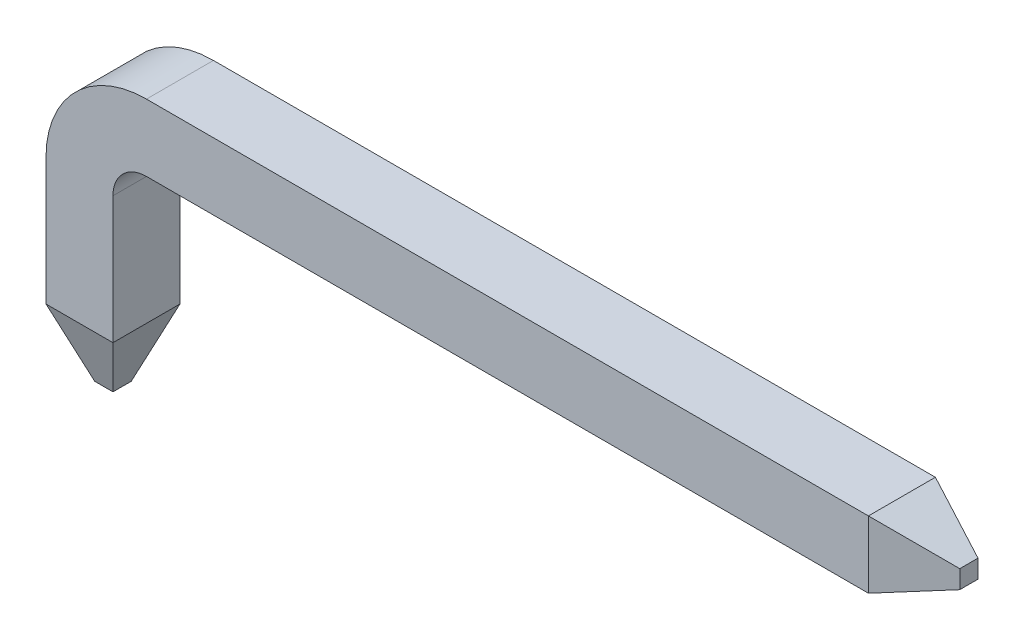
ISO-10303-21;
HEADER;
FILE_DESCRIPTION(('STEP AP214'),'2;1');
FILE_NAME('part.step','',(''),(''),'','','');
FILE_SCHEMA(('AUTOMOTIVE_DESIGN { 1 0 10303 214 1 1 1 1 }'));
ENDSEC;
DATA;
#1=APPLICATION_CONTEXT('core data for automotive mechanical design processes');
#2=APPLICATION_PROTOCOL_DEFINITION('international standard','automotive_design',2000,#1);
#3=PRODUCT_CONTEXT('',#1,'mechanical');
#4=PRODUCT('Part','Part','',(#3));
#5=PRODUCT_RELATED_PRODUCT_CATEGORY('part','',(#4));
#6=PRODUCT_DEFINITION_FORMATION('','',#4);
#7=PRODUCT_DEFINITION_CONTEXT('part definition',#1,'design');
#8=PRODUCT_DEFINITION('design','',#6,#7);
#9=PRODUCT_DEFINITION_SHAPE('','',#8);
#10=(LENGTH_UNIT() NAMED_UNIT(*) SI_UNIT(.MILLI.,.METRE.));
#11=(NAMED_UNIT(*) PLANE_ANGLE_UNIT() SI_UNIT($,.RADIAN.));
#12=(NAMED_UNIT(*) SI_UNIT($,.STERADIAN.) SOLID_ANGLE_UNIT());
#13=UNCERTAINTY_MEASURE_WITH_UNIT(LENGTH_MEASURE(1.E-05),#10,'distance_accuracy_value','');
#14=(GEOMETRIC_REPRESENTATION_CONTEXT(3) GLOBAL_UNCERTAINTY_ASSIGNED_CONTEXT((#13)) GLOBAL_UNIT_ASSIGNED_CONTEXT((#10,
#11,#12)) REPRESENTATION_CONTEXT('',''));
#15=CARTESIAN_POINT('',(0.,0.,0.));
#16=DIRECTION('',(0.,0.,1.));
#17=DIRECTION('',(1.,0.,0.));
#18=AXIS2_PLACEMENT_3D('',#15,#16,#17);
#19=CARTESIAN_POINT('',(0.75,1.2,0.));
#20=DIRECTION('',(0.,-1.,0.));
#21=DIRECTION('',(1.,0.,0.));
#22=AXIS2_PLACEMENT_3D('',#19,#20,#21);
#23=PLANE('',#22);
#24=DIRECTION('',(0.,0.,-1.));
#25=VECTOR('',#24,1.);
#26=CARTESIAN_POINT('',(0.75,1.2,0.));
#27=LINE('',#26,#25);
#28=CARTESIAN_POINT('',(0.75,1.2,0.));
#29=VERTEX_POINT('',#28);
#30=CARTESIAN_POINT('',(0.75,1.2,-0.5));
#31=VERTEX_POINT('',#30);
#32=EDGE_CURVE('E175',#29,#31,#27,.T.);
#33=ORIENTED_EDGE('',*,*,#32,.T.);
#34=DIRECTION('',(1.,0.,0.));
#35=VECTOR('',#34,1.);
#36=CARTESIAN_POINT('',(0.75,1.2,-0.5));
#37=LINE('',#36,#35);
#38=CARTESIAN_POINT('',(6.14,1.2,-0.5));
#39=VERTEX_POINT('',#38);
#40=EDGE_CURVE('E199',#31,#39,#37,.T.);
#41=ORIENTED_EDGE('',*,*,#40,.T.);
#42=DIRECTION('',(0.,0.,-1.));
#43=VECTOR('',#42,1.);
#44=CARTESIAN_POINT('',(6.14,1.2,0.));
#45=LINE('',#44,#43);
#46=CARTESIAN_POINT('',(6.14,1.2,0.));
#47=VERTEX_POINT('',#46);
#48=EDGE_CURVE('E53',#47,#39,#45,.T.);
#49=ORIENTED_EDGE('',*,*,#48,.F.);
#50=DIRECTION('',(1.,0.,0.));
#51=VECTOR('',#50,1.);
#52=CARTESIAN_POINT('',(0.75,1.2,0.));
#53=LINE('',#52,#51);
#54=EDGE_CURVE('E39',#29,#47,#53,.T.);
#55=ORIENTED_EDGE('',*,*,#54,.F.);
#56=EDGE_LOOP('',(#33,#41,#49,#55));
#57=FACE_BOUND('',#56,.T.);
#58=ADVANCED_FACE('F32',(#57),#23,.T.);
#59=CARTESIAN_POINT('',(0.75,1.7,0.));
#60=DIRECTION('',(0.,1.,0.));
#61=DIRECTION('',(-1.,0.,0.));
#62=AXIS2_PLACEMENT_3D('',#59,#60,#61);
#63=PLANE('',#62);
#64=DIRECTION('',(0.,0.,1.));
#65=VECTOR('',#64,1.);
#66=CARTESIAN_POINT('',(0.75,1.7,0.));
#67=LINE('',#66,#65);
#68=CARTESIAN_POINT('',(0.75,1.7,-0.5));
#69=VERTEX_POINT('',#68);
#70=CARTESIAN_POINT('',(0.75,1.7,0.));
#71=VERTEX_POINT('',#70);
#72=EDGE_CURVE('E172',#69,#71,#67,.T.);
#73=ORIENTED_EDGE('',*,*,#72,.T.);
#74=DIRECTION('',(1.,0.,0.));
#75=VECTOR('',#74,1.);
#76=CARTESIAN_POINT('',(0.75,1.7,0.));
#77=LINE('',#76,#75);
#78=CARTESIAN_POINT('',(6.14,1.7,0.));
#79=VERTEX_POINT('',#78);
#80=EDGE_CURVE('E11',#71,#79,#77,.T.);
#81=ORIENTED_EDGE('',*,*,#80,.T.);
#82=DIRECTION('',(0.,0.,1.));
#83=VECTOR('',#82,1.);
#84=CARTESIAN_POINT('',(6.14,1.7,0.));
#85=LINE('',#84,#83);
#86=CARTESIAN_POINT('',(6.14,1.7,-0.5));
#87=VERTEX_POINT('',#86);
#88=EDGE_CURVE('E189',#87,#79,#85,.T.);
#89=ORIENTED_EDGE('',*,*,#88,.F.);
#90=DIRECTION('',(1.,0.,0.));
#91=VECTOR('',#90,1.);
#92=CARTESIAN_POINT('',(0.75,1.7,-0.5));
#93=LINE('',#92,#91);
#94=EDGE_CURVE('E197',#69,#87,#93,.T.);
#95=ORIENTED_EDGE('',*,*,#94,.F.);
#96=EDGE_LOOP('',(#73,#81,#89,#95));
#97=FACE_BOUND('',#96,.T.);
#98=ADVANCED_FACE('F268',(#97),#63,.T.);
#99=CARTESIAN_POINT('',(0.75,0.95,0.));
#100=DIRECTION('',(0.,0.,-1.));
#101=DIRECTION('',(-1.,0.,0.));
#102=AXIS2_PLACEMENT_3D('',#99,#100,#101);
#103=CYLINDRICAL_SURFACE('',#102,0.25);
#104=DIRECTION('',(0.,0.,-1.));
#105=VECTOR('',#104,1.);
#106=CARTESIAN_POINT('',(0.5,0.95,0.));
#107=LINE('',#106,#105);
#108=CARTESIAN_POINT('',(0.5,0.95,0.));
#109=VERTEX_POINT('',#108);
#110=CARTESIAN_POINT('',(0.5,0.95,-0.5));
#111=VERTEX_POINT('',#110);
#112=EDGE_CURVE('E160',#109,#111,#107,.T.);
#113=ORIENTED_EDGE('',*,*,#112,.T.);
#114=CARTESIAN_POINT('',(0.75,0.95,-0.5));
#115=DIRECTION('',(0.,0.,-1.));
#116=DIRECTION('',(-1.,0.,0.));
#117=AXIS2_PLACEMENT_3D('',#114,#115,#116);
#118=CIRCLE('',#117,0.25);
#119=EDGE_CURVE('E180',#111,#31,#118,.T.);
#120=ORIENTED_EDGE('',*,*,#119,.T.);
#121=ORIENTED_EDGE('',*,*,#32,.F.);
#122=CARTESIAN_POINT('',(0.75,0.95,0.));
#123=DIRECTION('',(0.,0.,-1.));
#124=DIRECTION('',(-1.,0.,0.));
#125=AXIS2_PLACEMENT_3D('',#122,#123,#124);
#126=CIRCLE('',#125,0.25);
#127=EDGE_CURVE('E183',#109,#29,#126,.T.);
#128=ORIENTED_EDGE('',*,*,#127,.F.);
#129=EDGE_LOOP('',(#113,#120,#121,#128));
#130=FACE_BOUND('',#129,.T.);
#131=ADVANCED_FACE('F272',(#130),#103,.F.);
#132=CARTESIAN_POINT('',(0.75,0.95,0.));
#133=DIRECTION('',(0.,0.,-1.));
#134=DIRECTION('',(-1.,0.,0.));
#135=AXIS2_PLACEMENT_3D('',#132,#133,#134);
#136=CYLINDRICAL_SURFACE('',#135,0.75);
#137=DIRECTION('',(0.,0.,1.));
#138=VECTOR('',#137,1.);
#139=CARTESIAN_POINT('',(0.,0.95,0.));
#140=LINE('',#139,#138);
#141=CARTESIAN_POINT('',(0.,0.95,-0.5));
#142=VERTEX_POINT('',#141);
#143=CARTESIAN_POINT('',(0.,0.95,0.));
#144=VERTEX_POINT('',#143);
#145=EDGE_CURVE('E155',#142,#144,#140,.T.);
#146=ORIENTED_EDGE('',*,*,#145,.T.);
#147=CARTESIAN_POINT('',(0.75,0.95,0.));
#148=DIRECTION('',(0.,0.,-1.));
#149=DIRECTION('',(-1.,0.,0.));
#150=AXIS2_PLACEMENT_3D('',#147,#148,#149);
#151=CIRCLE('',#150,0.75);
#152=EDGE_CURVE('E186',#144,#71,#151,.T.);
#153=ORIENTED_EDGE('',*,*,#152,.T.);
#154=ORIENTED_EDGE('',*,*,#72,.F.);
#155=CARTESIAN_POINT('',(0.75,0.95,-0.5));
#156=DIRECTION('',(0.,0.,-1.));
#157=DIRECTION('',(-1.,0.,0.));
#158=AXIS2_PLACEMENT_3D('',#155,#156,#157);
#159=CIRCLE('',#158,0.75);
#160=EDGE_CURVE('E178',#142,#69,#159,.T.);
#161=ORIENTED_EDGE('',*,*,#160,.F.);
#162=EDGE_LOOP('',(#146,#153,#154,#161));
#163=FACE_BOUND('',#162,.T.);
#164=ADVANCED_FACE('F307',(#163),#136,.T.);
#165=CARTESIAN_POINT('',(0.,0.95,0.));
#166=DIRECTION('',(1.,0.,0.));
#167=DIRECTION('',(0.,0.,-1.));
#168=AXIS2_PLACEMENT_3D('',#165,#166,#167);
#169=PLANE('',#168);
#170=DIRECTION('',(0.,0.,1.));
#171=VECTOR('',#170,1.);
#172=CARTESIAN_POINT('',(0.,0.,0.));
#173=LINE('',#172,#171);
#174=CARTESIAN_POINT('',(0.,0.,-0.5));
#175=VERTEX_POINT('',#174);
#176=CARTESIAN_POINT('',(0.,0.,0.));
#177=VERTEX_POINT('',#176);
#178=EDGE_CURVE('E135',#175,#177,#173,.T.);
#179=ORIENTED_EDGE('',*,*,#178,.T.);
#180=DIRECTION('',(0.,-1.,0.));
#181=VECTOR('',#180,1.);
#182=CARTESIAN_POINT('',(0.,0.95,0.));
#183=LINE('',#182,#181);
#184=EDGE_CURVE('E170',#144,#177,#183,.T.);
#185=ORIENTED_EDGE('',*,*,#184,.F.);
#186=ORIENTED_EDGE('',*,*,#145,.F.);
#187=DIRECTION('',(0.,-1.,0.));
#188=VECTOR('',#187,1.);
#189=CARTESIAN_POINT('',(0.,0.95,-0.5));
#190=LINE('',#189,#188);
#191=EDGE_CURVE('E151',#142,#175,#190,.T.);
#192=ORIENTED_EDGE('',*,*,#191,.T.);
#193=EDGE_LOOP('',(#179,#185,#186,#192));
#194=FACE_BOUND('',#193,.T.);
#195=ADVANCED_FACE('F158',(#194),#169,.F.);
#196=CARTESIAN_POINT('',(0.,0.95,0.));
#197=DIRECTION('',(0.,0.,-1.));
#198=DIRECTION('',(-1.,0.,0.));
#199=AXIS2_PLACEMENT_3D('',#196,#197,#198);
#200=PLANE('',#199);
#201=DIRECTION('',(1.,0.,0.));
#202=VECTOR('',#201,1.);
#203=CARTESIAN_POINT('',(0.,0.,0.));
#204=LINE('',#203,#202);
#205=CARTESIAN_POINT('',(0.5,0.,0.));
#206=VERTEX_POINT('',#205);
#207=EDGE_CURVE('E143',#177,#206,#204,.T.);
#208=ORIENTED_EDGE('',*,*,#207,.T.);
#209=DIRECTION('',(0.,-1.,0.));
#210=VECTOR('',#209,1.);
#211=CARTESIAN_POINT('',(0.5,0.95,0.));
#212=LINE('',#211,#210);
#213=EDGE_CURVE('E162',#109,#206,#212,.T.);
#214=ORIENTED_EDGE('',*,*,#213,.F.);
#215=ORIENTED_EDGE('',*,*,#127,.T.);
#216=ORIENTED_EDGE('',*,*,#54,.T.);
#217=DIRECTION('',(0.,-1.,0.));
#218=VECTOR('',#217,1.);
#219=CARTESIAN_POINT('',(6.14,1.7,0.));
#220=LINE('',#219,#218);
#221=EDGE_CURVE('E46',#79,#47,#220,.T.);
#222=ORIENTED_EDGE('',*,*,#221,.F.);
#223=ORIENTED_EDGE('',*,*,#80,.F.);
#224=ORIENTED_EDGE('',*,*,#152,.F.);
#225=ORIENTED_EDGE('',*,*,#184,.T.);
#226=EDGE_LOOP('',(#208,#214,#215,#216,#222,#223,#224,#225));
#227=FACE_BOUND('',#226,.T.);
#228=ADVANCED_FACE('F202',(#227),#200,.F.);
#229=CARTESIAN_POINT('',(0.5,0.95,0.));
#230=DIRECTION('',(-1.,0.,0.));
#231=DIRECTION('',(0.,0.,1.));
#232=AXIS2_PLACEMENT_3D('',#229,#230,#231);
#233=PLANE('',#232);
#234=DIRECTION('',(0.,0.,-1.));
#235=VECTOR('',#234,1.);
#236=CARTESIAN_POINT('',(0.5,0.,0.));
#237=LINE('',#236,#235);
#238=CARTESIAN_POINT('',(0.5,0.,-0.5));
#239=VERTEX_POINT('',#238);
#240=EDGE_CURVE('E156',#206,#239,#237,.T.);
#241=ORIENTED_EDGE('',*,*,#240,.T.);
#242=DIRECTION('',(0.,-1.,0.));
#243=VECTOR('',#242,1.);
#244=CARTESIAN_POINT('',(0.5,0.95,-0.5));
#245=LINE('',#244,#243);
#246=EDGE_CURVE('E154',#111,#239,#245,.T.);
#247=ORIENTED_EDGE('',*,*,#246,.F.);
#248=ORIENTED_EDGE('',*,*,#112,.F.);
#249=ORIENTED_EDGE('',*,*,#213,.T.);
#250=EDGE_LOOP('',(#241,#247,#248,#249));
#251=FACE_BOUND('',#250,.T.);
#252=ADVANCED_FACE('F239',(#251),#233,.F.);
#253=CARTESIAN_POINT('',(0.,0.95,-0.5));
#254=DIRECTION('',(0.,0.,1.));
#255=DIRECTION('',(1.,0.,0.));
#256=AXIS2_PLACEMENT_3D('',#253,#254,#255);
#257=PLANE('',#256);
#258=DIRECTION('',(-1.,0.,0.));
#259=VECTOR('',#258,1.);
#260=CARTESIAN_POINT('',(0.,0.,-0.5));
#261=LINE('',#260,#259);
#262=EDGE_CURVE('E124',#239,#175,#261,.T.);
#263=ORIENTED_EDGE('',*,*,#262,.T.);
#264=ORIENTED_EDGE('',*,*,#191,.F.);
#265=ORIENTED_EDGE('',*,*,#160,.T.);
#266=ORIENTED_EDGE('',*,*,#94,.T.);
#267=DIRECTION('',(0.,1.,0.));
#268=VECTOR('',#267,1.);
#269=CARTESIAN_POINT('',(6.14,1.7,-0.5));
#270=LINE('',#269,#268);
#271=EDGE_CURVE('E192',#39,#87,#270,.T.);
#272=ORIENTED_EDGE('',*,*,#271,.F.);
#273=ORIENTED_EDGE('',*,*,#40,.F.);
#274=ORIENTED_EDGE('',*,*,#119,.F.);
#275=ORIENTED_EDGE('',*,*,#246,.T.);
#276=EDGE_LOOP('',(#263,#264,#265,#266,#272,#273,#274,#275));
#277=FACE_BOUND('',#276,.T.);
#278=ADVANCED_FACE('F149',(#277),#257,.F.);
#279=CARTESIAN_POINT('',(6.14,1.7,0.));
#280=DIRECTION('',(0.342020143325669,0.,0.939692620785908));
#281=DIRECTION('',(0.939692620785909,0.,-0.342020143325669));
#282=AXIS2_PLACEMENT_3D('',#279,#280,#281);
#283=PLANE('',#282);
#284=ORIENTED_EDGE('',*,*,#221,.T.);
#285=DIRECTION('',(-0.889126490715988,-0.323615577118185,0.323615577118185));
#286=VECTOR('',#285,1.);
#287=CARTESIAN_POINT('',(6.14,1.2,0.));
#288=LINE('',#287,#286);
#289=CARTESIAN_POINT('',(6.64,1.3819851171331,-0.181985117133101));
#290=VERTEX_POINT('',#289);
#291=EDGE_CURVE('E144',#290,#47,#288,.T.);
#292=ORIENTED_EDGE('',*,*,#291,.F.);
#293=DIRECTION('',(0.,1.,0.));
#294=VECTOR('',#293,1.);
#295=CARTESIAN_POINT('',(6.64,1.7,-0.181985117133101));
#296=LINE('',#295,#294);
#297=CARTESIAN_POINT('',(6.64,1.5180148828669,-0.181985117133101));
#298=VERTEX_POINT('',#297);
#299=EDGE_CURVE('E130',#298,#290,#296,.F.);
#300=ORIENTED_EDGE('',*,*,#299,.F.);
#301=DIRECTION('',(-0.889126490715988,0.323615577118184,0.323615577118185));
#302=VECTOR('',#301,1.);
#303=CARTESIAN_POINT('',(6.14,1.7,0.));
#304=LINE('',#303,#302);
#305=EDGE_CURVE('E219',#298,#79,#304,.T.);
#306=ORIENTED_EDGE('',*,*,#305,.T.);
#307=EDGE_LOOP('',(#284,#292,#300,#306));
#308=FACE_BOUND('',#307,.T.);
#309=ADVANCED_FACE('F217',(#308),#283,.T.);
#310=CARTESIAN_POINT('',(6.14,1.2,0.));
#311=DIRECTION('',(0.342020143325669,-0.939692620785908,0.));
#312=DIRECTION('',(0.939692620785908,0.342020143325669,0.));
#313=AXIS2_PLACEMENT_3D('',#310,#311,#312);
#314=PLANE('',#313);
#315=ORIENTED_EDGE('',*,*,#48,.T.);
#316=DIRECTION('',(-0.889126490715988,-0.323615577118185,-0.323615577118185));
#317=VECTOR('',#316,1.);
#318=CARTESIAN_POINT('',(6.28386759121206,1.25236352087677,-0.447636479123232));
#319=LINE('',#318,#317);
#320=CARTESIAN_POINT('',(6.64,1.3819851171331,-0.318014882866899));
#321=VERTEX_POINT('',#320);
#322=EDGE_CURVE('E214',#321,#39,#319,.T.);
#323=ORIENTED_EDGE('',*,*,#322,.F.);
#324=DIRECTION('',(0.,0.,1.));
#325=VECTOR('',#324,1.);
#326=CARTESIAN_POINT('',(6.64,1.3819851171331,0.));
#327=LINE('',#326,#325);
#328=EDGE_CURVE('E210',#290,#321,#327,.F.);
#329=ORIENTED_EDGE('',*,*,#328,.F.);
#330=ORIENTED_EDGE('',*,*,#291,.T.);
#331=EDGE_LOOP('',(#315,#323,#329,#330));
#332=FACE_BOUND('',#331,.T.);
#333=ADVANCED_FACE('F207',(#332),#314,.T.);
#334=CARTESIAN_POINT('',(6.14,1.7,-0.5));
#335=DIRECTION('',(0.342020143325669,0.,-0.939692620785908));
#336=DIRECTION('',(-0.939692620785909,0.,-0.342020143325669));
#337=AXIS2_PLACEMENT_3D('',#334,#335,#336);
#338=PLANE('',#337);
#339=ORIENTED_EDGE('',*,*,#271,.T.);
#340=DIRECTION('',(-0.889126490715988,0.323615577118184,-0.323615577118185));
#341=VECTOR('',#340,1.);
#342=CARTESIAN_POINT('',(6.28386759121206,1.64763647912323,-0.447636479123232));
#343=LINE('',#342,#341);
#344=CARTESIAN_POINT('',(6.64,1.5180148828669,-0.318014882866899));
#345=VERTEX_POINT('',#344);
#346=EDGE_CURVE('E222',#345,#87,#343,.T.);
#347=ORIENTED_EDGE('',*,*,#346,.F.);
#348=DIRECTION('',(0.,-1.,0.));
#349=VECTOR('',#348,1.);
#350=CARTESIAN_POINT('',(6.64,1.7,-0.318014882866899));
#351=LINE('',#350,#349);
#352=EDGE_CURVE('E227',#321,#345,#351,.F.);
#353=ORIENTED_EDGE('',*,*,#352,.F.);
#354=ORIENTED_EDGE('',*,*,#322,.T.);
#355=EDGE_LOOP('',(#339,#347,#353,#354));
#356=FACE_BOUND('',#355,.T.);
#357=ADVANCED_FACE('F278',(#356),#338,.T.);
#358=CARTESIAN_POINT('',(6.14,1.7,0.));
#359=DIRECTION('',(0.342020143325668,0.939692620785909,0.));
#360=DIRECTION('',(-0.939692620785909,0.342020143325668,0.));
#361=AXIS2_PLACEMENT_3D('',#358,#359,#360);
#362=PLANE('',#361);
#363=ORIENTED_EDGE('',*,*,#88,.T.);
#364=ORIENTED_EDGE('',*,*,#305,.F.);
#365=DIRECTION('',(0.,0.,-1.));
#366=VECTOR('',#365,1.);
#367=CARTESIAN_POINT('',(6.64,1.5180148828669,0.));
#368=LINE('',#367,#366);
#369=EDGE_CURVE('E223',#345,#298,#368,.F.);
#370=ORIENTED_EDGE('',*,*,#369,.F.);
#371=ORIENTED_EDGE('',*,*,#346,.T.);
#372=EDGE_LOOP('',(#363,#364,#370,#371));
#373=FACE_BOUND('',#372,.T.);
#374=ADVANCED_FACE('F280',(#373),#362,.T.);
#375=CARTESIAN_POINT('',(6.64,1.2,0.));
#376=DIRECTION('',(1.,0.,0.));
#377=DIRECTION('',(0.,0.,-1.));
#378=AXIS2_PLACEMENT_3D('',#375,#376,#377);
#379=PLANE('',#378);
#380=ORIENTED_EDGE('',*,*,#299,.T.);
#381=ORIENTED_EDGE('',*,*,#328,.T.);
#382=ORIENTED_EDGE('',*,*,#352,.T.);
#383=ORIENTED_EDGE('',*,*,#369,.T.);
#384=EDGE_LOOP('',(#380,#381,#382,#383));
#385=FACE_BOUND('',#384,.T.);
#386=ADVANCED_FACE('F282',(#385),#379,.T.);
#387=CARTESIAN_POINT('',(0.,0.,0.));
#388=DIRECTION('',(-0.939692620785908,-0.342020143325669,0.));
#389=DIRECTION('',(0.342020143325669,-0.939692620785909,0.));
#390=AXIS2_PLACEMENT_3D('',#387,#388,#389);
#391=PLANE('',#390);
#392=ORIENTED_EDGE('',*,*,#178,.F.);
#393=DIRECTION('',(-0.323615577118185,0.889126490715988,-0.323615577118185));
#394=VECTOR('',#393,1.);
#395=CARTESIAN_POINT('',(0.,0.,-0.5));
#396=LINE('',#395,#394);
#397=CARTESIAN_POINT('',(0.181985117133101,-0.5,-0.318014882866899));
#398=VERTEX_POINT('',#397);
#399=EDGE_CURVE('E119',#398,#175,#396,.T.);
#400=ORIENTED_EDGE('',*,*,#399,.F.);
#401=DIRECTION('',(0.,0.,1.));
#402=VECTOR('',#401,1.);
#403=CARTESIAN_POINT('',(0.181985117133101,-0.5,0.));
#404=LINE('',#403,#402);
#405=CARTESIAN_POINT('',(0.181985117133101,-0.5,-0.181985117133101));
#406=VERTEX_POINT('',#405);
#407=EDGE_CURVE('E254',#406,#398,#404,.F.);
#408=ORIENTED_EDGE('',*,*,#407,.F.);
#409=DIRECTION('',(-0.323615577118185,0.889126490715988,0.323615577118185));
#410=VECTOR('',#409,1.);
#411=CARTESIAN_POINT('',(0.,0.,0.));
#412=LINE('',#411,#410);
#413=EDGE_CURVE('E138',#406,#177,#412,.T.);
#414=ORIENTED_EDGE('',*,*,#413,.T.);
#415=EDGE_LOOP('',(#392,#400,#408,#414));
#416=FACE_BOUND('',#415,.T.);
#417=ADVANCED_FACE('F136',(#416),#391,.T.);
#418=CARTESIAN_POINT('',(0.,0.,-0.5));
#419=DIRECTION('',(0.,-0.342020143325669,-0.939692620785908));
#420=DIRECTION('',(0.,0.939692620785909,-0.342020143325669));
#421=AXIS2_PLACEMENT_3D('',#418,#419,#420);
#422=PLANE('',#421);
#423=ORIENTED_EDGE('',*,*,#262,.F.);
#424=DIRECTION('',(0.323615577118185,0.889126490715988,-0.323615577118185));
#425=VECTOR('',#424,1.);
#426=CARTESIAN_POINT('',(0.447636479123232,-0.143867591212061,-0.447636479123232));
#427=LINE('',#426,#425);
#428=CARTESIAN_POINT('',(0.318014882866899,-0.5,-0.318014882866899));
#429=VERTEX_POINT('',#428);
#430=EDGE_CURVE('E131',#429,#239,#427,.T.);
#431=ORIENTED_EDGE('',*,*,#430,.F.);
#432=DIRECTION('',(-1.,0.,0.));
#433=VECTOR('',#432,1.);
#434=CARTESIAN_POINT('',(0.,-0.5,-0.318014882866899));
#435=LINE('',#434,#433);
#436=EDGE_CURVE('E126',#398,#429,#435,.F.);
#437=ORIENTED_EDGE('',*,*,#436,.F.);
#438=ORIENTED_EDGE('',*,*,#399,.T.);
#439=EDGE_LOOP('',(#423,#431,#437,#438));
#440=FACE_BOUND('',#439,.T.);
#441=ADVANCED_FACE('F121',(#440),#422,.T.);
#442=CARTESIAN_POINT('',(0.5,0.,0.));
#443=DIRECTION('',(0.939692620785908,-0.342020143325669,0.));
#444=DIRECTION('',(0.342020143325669,0.939692620785909,0.));
#445=AXIS2_PLACEMENT_3D('',#442,#443,#444);
#446=PLANE('',#445);
#447=ORIENTED_EDGE('',*,*,#240,.F.);
#448=DIRECTION('',(0.323615577118185,0.889126490715988,0.323615577118185));
#449=VECTOR('',#448,1.);
#450=CARTESIAN_POINT('',(0.447636479123232,-0.143867591212061,-0.052363520876768));
#451=LINE('',#450,#449);
#452=CARTESIAN_POINT('',(0.318014882866899,-0.5,-0.181985117133101));
#453=VERTEX_POINT('',#452);
#454=EDGE_CURVE('E245',#453,#206,#451,.T.);
#455=ORIENTED_EDGE('',*,*,#454,.F.);
#456=DIRECTION('',(0.,0.,-1.));
#457=VECTOR('',#456,1.);
#458=CARTESIAN_POINT('',(0.318014882866899,-0.5,0.));
#459=LINE('',#458,#457);
#460=EDGE_CURVE('E257',#429,#453,#459,.F.);
#461=ORIENTED_EDGE('',*,*,#460,.F.);
#462=ORIENTED_EDGE('',*,*,#430,.T.);
#463=EDGE_LOOP('',(#447,#455,#461,#462));
#464=FACE_BOUND('',#463,.T.);
#465=ADVANCED_FACE('F243',(#464),#446,.T.);
#466=CARTESIAN_POINT('',(0.,0.,0.));
#467=DIRECTION('',(0.,-0.342020143325669,0.939692620785908));
#468=DIRECTION('',(0.,-0.939692620785909,-0.342020143325669));
#469=AXIS2_PLACEMENT_3D('',#466,#467,#468);
#470=PLANE('',#469);
#471=ORIENTED_EDGE('',*,*,#207,.F.);
#472=ORIENTED_EDGE('',*,*,#413,.F.);
#473=DIRECTION('',(1.,0.,0.));
#474=VECTOR('',#473,1.);
#475=CARTESIAN_POINT('',(0.,-0.5,-0.181985117133101));
#476=LINE('',#475,#474);
#477=EDGE_CURVE('E249',#453,#406,#476,.F.);
#478=ORIENTED_EDGE('',*,*,#477,.F.);
#479=ORIENTED_EDGE('',*,*,#454,.T.);
#480=EDGE_LOOP('',(#471,#472,#478,#479));
#481=FACE_BOUND('',#480,.T.);
#482=ADVANCED_FACE('F248',(#481),#470,.T.);
#483=CARTESIAN_POINT('',(0.,-0.5,-0.5));
#484=DIRECTION('',(0.,-1.,0.));
#485=DIRECTION('',(0.,0.,-1.));
#486=AXIS2_PLACEMENT_3D('',#483,#484,#485);
#487=PLANE('',#486);
#488=ORIENTED_EDGE('',*,*,#407,.T.);
#489=ORIENTED_EDGE('',*,*,#436,.T.);
#490=ORIENTED_EDGE('',*,*,#460,.T.);
#491=ORIENTED_EDGE('',*,*,#477,.T.);
#492=EDGE_LOOP('',(#488,#489,#490,#491));
#493=FACE_BOUND('',#492,.T.);
#494=ADVANCED_FACE('F259',(#493),#487,.T.);
#495=CLOSED_SHELL('',(#58,#98,#131,#164,#195,#228,#252,#278,#309,#333,#357,#374,#386,#417,#441,
#465,#482,#494));
#496=MANIFOLD_SOLID_BREP('B2',#495);
#497=ADVANCED_BREP_SHAPE_REPRESENTATION('',(#18,#496),#14);
#498=SHAPE_DEFINITION_REPRESENTATION(#9,#497);
ENDSEC;
END-ISO-10303-21;
